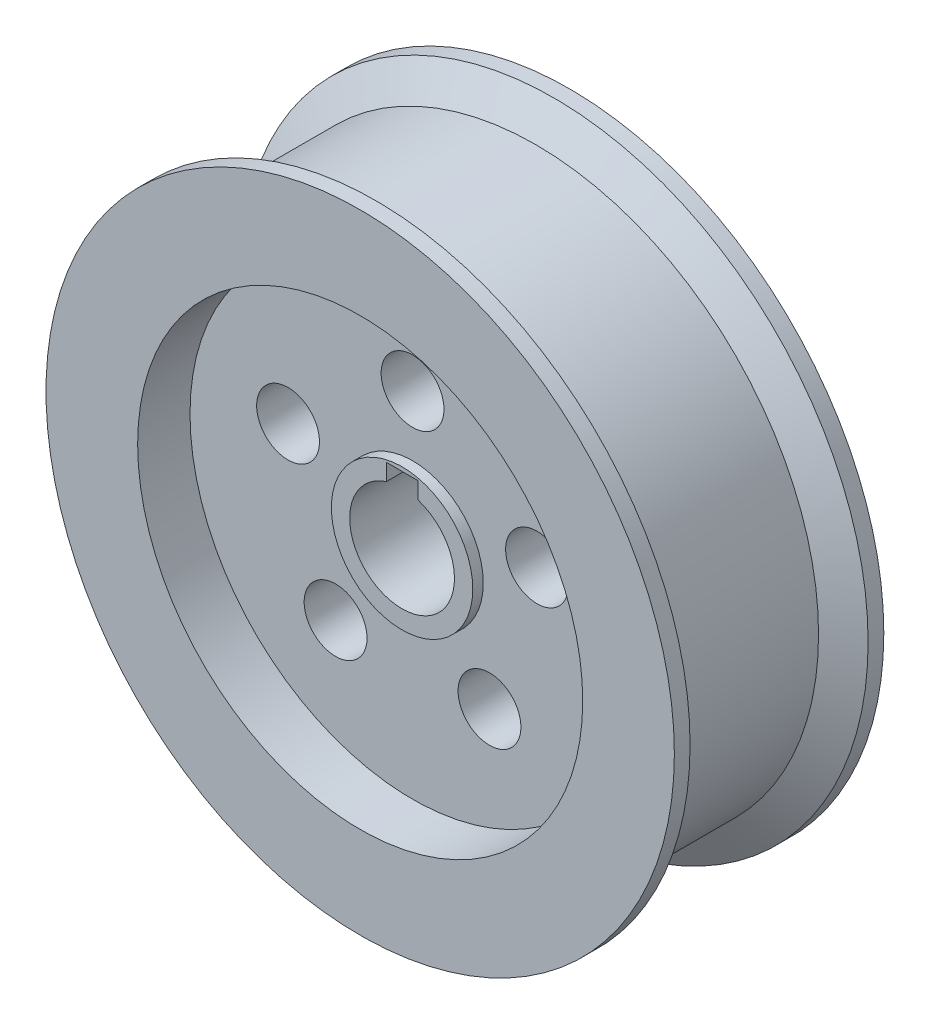
ISO-10303-21;
HEADER;
FILE_DESCRIPTION(('STEP AP214'),'2;1');
FILE_NAME('part.step','',(''),(''),'','','');
FILE_SCHEMA(('AUTOMOTIVE_DESIGN { 1 0 10303 214 1 1 1 1 }'));
ENDSEC;
DATA;
#1=APPLICATION_CONTEXT('core data for automotive mechanical design processes');
#2=APPLICATION_PROTOCOL_DEFINITION('international standard','automotive_design',2000,#1);
#3=PRODUCT_CONTEXT('',#1,'mechanical');
#4=PRODUCT('Part','Part','',(#3));
#5=PRODUCT_RELATED_PRODUCT_CATEGORY('part','',(#4));
#6=PRODUCT_DEFINITION_FORMATION('','',#4);
#7=PRODUCT_DEFINITION_CONTEXT('part definition',#1,'design');
#8=PRODUCT_DEFINITION('design','',#6,#7);
#9=PRODUCT_DEFINITION_SHAPE('','',#8);
#10=(LENGTH_UNIT() NAMED_UNIT(*) SI_UNIT(.MILLI.,.METRE.));
#11=(NAMED_UNIT(*) PLANE_ANGLE_UNIT() SI_UNIT($,.RADIAN.));
#12=(NAMED_UNIT(*) SI_UNIT($,.STERADIAN.) SOLID_ANGLE_UNIT());
#13=UNCERTAINTY_MEASURE_WITH_UNIT(LENGTH_MEASURE(1.E-05),#10,'distance_accuracy_value','');
#14=(GEOMETRIC_REPRESENTATION_CONTEXT(3) GLOBAL_UNCERTAINTY_ASSIGNED_CONTEXT((#13)) GLOBAL_UNIT_ASSIGNED_CONTEXT((#10,
#11,#12)) REPRESENTATION_CONTEXT('',''));
#15=CARTESIAN_POINT('',(0.,0.,0.));
#16=DIRECTION('',(0.,0.,1.));
#17=DIRECTION('',(1.,0.,0.));
#18=AXIS2_PLACEMENT_3D('',#15,#16,#17);
#19=CARTESIAN_POINT('',(0.,0.,20.));
#20=DIRECTION('',(0.,0.,-1.));
#21=DIRECTION('',(-1.,0.,0.));
#22=AXIS2_PLACEMENT_3D('',#19,#20,#21);
#23=CYLINDRICAL_SURFACE('',#22,60.);
#24=CARTESIAN_POINT('',(0.,0.,-17.));
#25=DIRECTION('',(0.,0.,1.));
#26=DIRECTION('',(1.,0.,0.));
#27=AXIS2_PLACEMENT_3D('',#24,#25,#26);
#28=CIRCLE('',#27,60.);
#29=CARTESIAN_POINT('',(60.,0.,-17.));
#30=VERTEX_POINT('',#29);
#31=EDGE_CURVE('E129',#30,#30,#28,.T.);
#32=ORIENTED_EDGE('',*,*,#31,.F.);
#33=EDGE_LOOP('',(#32));
#34=FACE_BOUND('',#33,.T.);
#35=CARTESIAN_POINT('',(0.,0.,-20.));
#36=DIRECTION('',(0.,0.,1.));
#37=DIRECTION('',(1.,0.,0.));
#38=AXIS2_PLACEMENT_3D('',#35,#36,#37);
#39=CIRCLE('',#38,60.);
#40=CARTESIAN_POINT('',(60.,0.,-20.));
#41=VERTEX_POINT('',#40);
#42=EDGE_CURVE('E174',#41,#41,#39,.T.);
#43=ORIENTED_EDGE('',*,*,#42,.T.);
#44=EDGE_LOOP('',(#43));
#45=FACE_BOUND('',#44,.T.);
#46=ADVANCED_FACE('F41',(#34,#45),#23,.T.);
#47=CARTESIAN_POINT('',(0.,0.,20.));
#48=DIRECTION('',(0.,0.,-1.));
#49=DIRECTION('',(-1.,0.,0.));
#50=AXIS2_PLACEMENT_3D('',#47,#48,#49);
#51=CYLINDRICAL_SURFACE('',#50,10.);
#52=DIRECTION('',(0.,0.,-1.));
#53=VECTOR('',#52,1.);
#54=CARTESIAN_POINT('',(-3.,9.53939201416946,20.));
#55=LINE('',#54,#53);
#56=CARTESIAN_POINT('',(-3.,9.53939201416946,12.));
#57=VERTEX_POINT('',#56);
#58=CARTESIAN_POINT('',(-3.,9.53939201416946,-10.));
#59=VERTEX_POINT('',#58);
#60=EDGE_CURVE('E64',#57,#59,#55,.T.);
#61=ORIENTED_EDGE('',*,*,#60,.F.);
#62=CARTESIAN_POINT('',(0.,0.,12.));
#63=DIRECTION('',(0.,0.,1.));
#64=DIRECTION('',(1.,0.,0.));
#65=AXIS2_PLACEMENT_3D('',#62,#63,#64);
#66=CIRCLE('',#65,10.);
#67=CARTESIAN_POINT('',(3.,9.53939201416946,12.));
#68=VERTEX_POINT('',#67);
#69=EDGE_CURVE('E113',#57,#68,#66,.T.);
#70=ORIENTED_EDGE('',*,*,#69,.T.);
#71=DIRECTION('',(0.,0.,-1.));
#72=VECTOR('',#71,1.);
#73=CARTESIAN_POINT('',(3.,9.53939201416946,20.));
#74=LINE('',#73,#72);
#75=CARTESIAN_POINT('',(3.,9.53939201416946,-10.));
#76=VERTEX_POINT('',#75);
#77=EDGE_CURVE('E88',#76,#68,#74,.F.);
#78=ORIENTED_EDGE('',*,*,#77,.F.);
#79=CARTESIAN_POINT('',(0.,0.,-10.));
#80=DIRECTION('',(0.,0.,-1.));
#81=DIRECTION('',(-1.,0.,0.));
#82=AXIS2_PLACEMENT_3D('',#79,#80,#81);
#83=CIRCLE('',#82,10.);
#84=EDGE_CURVE('E102',#76,#59,#83,.T.);
#85=ORIENTED_EDGE('',*,*,#84,.T.);
#86=EDGE_LOOP('',(#61,#70,#78,#85));
#87=FACE_BOUND('',#86,.T.);
#88=ADVANCED_FACE('F219',(#87),#51,.F.);
#89=CARTESIAN_POINT('',(0.,0.,20.));
#90=DIRECTION('',(0.,0.,1.));
#91=DIRECTION('',(1.,0.,0.));
#92=AXIS2_PLACEMENT_3D('',#89,#90,#91);
#93=PLANE('',#92);
#94=CARTESIAN_POINT('',(0.,0.,20.));
#95=DIRECTION('',(0.,0.,1.));
#96=DIRECTION('',(1.,0.,0.));
#97=AXIS2_PLACEMENT_3D('',#94,#95,#96);
#98=CIRCLE('',#97,42.5);
#99=CARTESIAN_POINT('',(42.5,0.,20.));
#100=VERTEX_POINT('',#99);
#101=EDGE_CURVE('E175',#100,#100,#98,.T.);
#102=ORIENTED_EDGE('',*,*,#101,.F.);
#103=EDGE_LOOP('',(#102));
#104=FACE_BOUND('',#103,.T.);
#105=CARTESIAN_POINT('',(0.,0.,20.));
#106=DIRECTION('',(0.,0.,1.));
#107=DIRECTION('',(1.,0.,0.));
#108=AXIS2_PLACEMENT_3D('',#105,#106,#107);
#109=CIRCLE('',#108,60.);
#110=CARTESIAN_POINT('',(60.,0.,20.));
#111=VERTEX_POINT('',#110);
#112=EDGE_CURVE('E179',#111,#111,#109,.T.);
#113=ORIENTED_EDGE('',*,*,#112,.T.);
#114=EDGE_LOOP('',(#113));
#115=FACE_BOUND('',#114,.T.);
#116=ADVANCED_FACE('F221',(#104,#115),#93,.T.);
#117=CARTESIAN_POINT('',(0.,0.,-20.));
#118=DIRECTION('',(0.,0.,1.));
#119=DIRECTION('',(1.,0.,0.));
#120=AXIS2_PLACEMENT_3D('',#117,#118,#119);
#121=PLANE('',#120);
#122=CARTESIAN_POINT('',(0.,0.,-20.));
#123=DIRECTION('',(0.,0.,1.));
#124=DIRECTION('',(1.,0.,0.));
#125=AXIS2_PLACEMENT_3D('',#122,#123,#124);
#126=CIRCLE('',#125,42.5);
#127=CARTESIAN_POINT('',(42.5,0.,-20.));
#128=VERTEX_POINT('',#127);
#129=EDGE_CURVE('E162',#128,#128,#126,.T.);
#130=ORIENTED_EDGE('',*,*,#129,.T.);
#131=EDGE_LOOP('',(#130));
#132=FACE_BOUND('',#131,.T.);
#133=ORIENTED_EDGE('',*,*,#42,.F.);
#134=EDGE_LOOP('',(#133));
#135=FACE_BOUND('',#134,.T.);
#136=ADVANCED_FACE('F227',(#132,#135),#121,.F.);
#137=CARTESIAN_POINT('',(0.,0.,17.));
#138=DIRECTION('',(0.,0.,1.));
#139=DIRECTION('',(1.,0.,0.));
#140=AXIS2_PLACEMENT_3D('',#137,#138,#139);
#141=CIRCLE('',#140,60.);
#142=CARTESIAN_POINT('',(60.,0.,17.));
#143=VERTEX_POINT('',#142);
#144=EDGE_CURVE('E125',#143,#143,#141,.T.);
#145=ORIENTED_EDGE('',*,*,#144,.T.);
#146=EDGE_LOOP('',(#145));
#147=FACE_BOUND('',#146,.T.);
#148=ORIENTED_EDGE('',*,*,#112,.F.);
#149=EDGE_LOOP('',(#148));
#150=FACE_BOUND('',#149,.T.);
#151=ADVANCED_FACE('F43',(#147,#150),#23,.T.);
#152=CARTESIAN_POINT('',(0.,0.,10.));
#153=DIRECTION('',(0.,0.,1.));
#154=DIRECTION('',(1.,0.,0.));
#155=AXIS2_PLACEMENT_3D('',#152,#153,#154);
#156=CYLINDRICAL_SURFACE('',#155,42.5);
#157=CARTESIAN_POINT('',(0.,0.,10.));
#158=DIRECTION('',(0.,0.,1.));
#159=DIRECTION('',(1.,0.,0.));
#160=AXIS2_PLACEMENT_3D('',#157,#158,#159);
#161=CIRCLE('',#160,42.5);
#162=CARTESIAN_POINT('',(42.5,0.,10.));
#163=VERTEX_POINT('',#162);
#164=EDGE_CURVE('E170',#163,#163,#161,.T.);
#165=ORIENTED_EDGE('',*,*,#164,.F.);
#166=EDGE_LOOP('',(#165));
#167=FACE_BOUND('',#166,.T.);
#168=ORIENTED_EDGE('',*,*,#101,.T.);
#169=EDGE_LOOP('',(#168));
#170=FACE_BOUND('',#169,.T.);
#171=ADVANCED_FACE('F232',(#167,#170),#156,.F.);
#172=CARTESIAN_POINT('',(0.,0.,10.));
#173=DIRECTION('',(0.,0.,1.));
#174=DIRECTION('',(1.,0.,0.));
#175=AXIS2_PLACEMENT_3D('',#172,#173,#174);
#176=PLANE('',#175);
#177=CARTESIAN_POINT('',(0.,0.,10.));
#178=DIRECTION('',(0.,0.,1.));
#179=DIRECTION('',(1.,0.,0.));
#180=AXIS2_PLACEMENT_3D('',#177,#178,#179);
#181=CIRCLE('',#180,13.5);
#182=CARTESIAN_POINT('',(13.5,0.,10.));
#183=VERTEX_POINT('',#182);
#184=EDGE_CURVE('E183',#183,#183,#181,.T.);
#185=ORIENTED_EDGE('',*,*,#184,.F.);
#186=EDGE_LOOP('',(#185));
#187=FACE_BOUND('',#186,.T.);
#188=CARTESIAN_POINT('',(14.6946313073117,-20.2254248593738,10.));
#189=DIRECTION('',(0.,0.,1.));
#190=DIRECTION('',(1.,0.,0.));
#191=AXIS2_PLACEMENT_3D('',#188,#189,#190);
#192=CIRCLE('',#191,6.);
#193=CARTESIAN_POINT('',(20.6946313073117,-20.2254248593738,10.));
#194=VERTEX_POINT('',#193);
#195=EDGE_CURVE('E148',#194,#194,#192,.T.);
#196=ORIENTED_EDGE('',*,*,#195,.F.);
#197=EDGE_LOOP('',(#196));
#198=FACE_BOUND('',#197,.T.);
#199=CARTESIAN_POINT('',(-14.694631307312,-20.2254248593736,10.));
#200=DIRECTION('',(0.,0.,1.));
#201=DIRECTION('',(1.,0.,0.));
#202=AXIS2_PLACEMENT_3D('',#199,#200,#201);
#203=CIRCLE('',#202,6.);
#204=CARTESIAN_POINT('',(-8.69463130731201,-20.2254248593736,10.));
#205=VERTEX_POINT('',#204);
#206=EDGE_CURVE('E143',#205,#205,#203,.T.);
#207=ORIENTED_EDGE('',*,*,#206,.F.);
#208=EDGE_LOOP('',(#207));
#209=FACE_BOUND('',#208,.T.);
#210=CARTESIAN_POINT('',(-23.7764129073788,7.72542485937396,10.));
#211=DIRECTION('',(0.,0.,1.));
#212=DIRECTION('',(1.,0.,0.));
#213=AXIS2_PLACEMENT_3D('',#210,#211,#212);
#214=CIRCLE('',#213,6.);
#215=CARTESIAN_POINT('',(-17.7764129073787,7.72542485937396,10.));
#216=VERTEX_POINT('',#215);
#217=EDGE_CURVE('E138',#216,#216,#214,.T.);
#218=ORIENTED_EDGE('',*,*,#217,.F.);
#219=EDGE_LOOP('',(#218));
#220=FACE_BOUND('',#219,.T.);
#221=CARTESIAN_POINT('',(23.7764129073789,7.72542485937362,10.));
#222=DIRECTION('',(0.,0.,1.));
#223=DIRECTION('',(1.,0.,0.));
#224=AXIS2_PLACEMENT_3D('',#221,#222,#223);
#225=CIRCLE('',#224,6.);
#226=CARTESIAN_POINT('',(29.7764129073789,7.72542485937362,10.));
#227=VERTEX_POINT('',#226);
#228=EDGE_CURVE('E153',#227,#227,#225,.T.);
#229=ORIENTED_EDGE('',*,*,#228,.F.);
#230=EDGE_LOOP('',(#229));
#231=FACE_BOUND('',#230,.T.);
#232=CARTESIAN_POINT('',(0.,25.,10.));
#233=DIRECTION('',(0.,0.,1.));
#234=DIRECTION('',(1.,0.,0.));
#235=AXIS2_PLACEMENT_3D('',#232,#233,#234);
#236=CIRCLE('',#235,6.);
#237=CARTESIAN_POINT('',(6.,25.,10.));
#238=VERTEX_POINT('',#237);
#239=EDGE_CURVE('E158',#238,#238,#236,.T.);
#240=ORIENTED_EDGE('',*,*,#239,.F.);
#241=EDGE_LOOP('',(#240));
#242=FACE_BOUND('',#241,.T.);
#243=ORIENTED_EDGE('',*,*,#164,.T.);
#244=EDGE_LOOP('',(#243));
#245=FACE_BOUND('',#244,.T.);
#246=ADVANCED_FACE('F247',(#187,#198,#209,#220,#231,#242,#245),#176,.T.);
#247=CARTESIAN_POINT('',(0.,0.,-10.));
#248=DIRECTION('',(0.,0.,-1.));
#249=DIRECTION('',(-1.,0.,0.));
#250=AXIS2_PLACEMENT_3D('',#247,#248,#249);
#251=CYLINDRICAL_SURFACE('',#250,42.5);
#252=CARTESIAN_POINT('',(0.,0.,-10.));
#253=DIRECTION('',(0.,0.,1.));
#254=DIRECTION('',(1.,0.,0.));
#255=AXIS2_PLACEMENT_3D('',#252,#253,#254);
#256=CIRCLE('',#255,42.5);
#257=CARTESIAN_POINT('',(42.5,0.,-10.));
#258=VERTEX_POINT('',#257);
#259=EDGE_CURVE('E163',#258,#258,#256,.T.);
#260=ORIENTED_EDGE('',*,*,#259,.T.);
#261=EDGE_LOOP('',(#260));
#262=FACE_BOUND('',#261,.T.);
#263=ORIENTED_EDGE('',*,*,#129,.F.);
#264=EDGE_LOOP('',(#263));
#265=FACE_BOUND('',#264,.T.);
#266=ADVANCED_FACE('F245',(#262,#265),#251,.F.);
#267=CARTESIAN_POINT('',(0.,0.,-10.));
#268=DIRECTION('',(0.,0.,-1.));
#269=DIRECTION('',(1.,0.,0.));
#270=AXIS2_PLACEMENT_3D('',#267,#268,#269);
#271=PLANE('',#270);
#272=DIRECTION('',(0.,1.,0.));
#273=VECTOR('',#272,1.);
#274=CARTESIAN_POINT('',(-3.,0.,-10.));
#275=LINE('',#274,#273);
#276=CARTESIAN_POINT('',(-3.,12.7268825510784,-10.));
#277=VERTEX_POINT('',#276);
#278=EDGE_CURVE('E107',#59,#277,#275,.T.);
#279=ORIENTED_EDGE('',*,*,#278,.F.);
#280=ORIENTED_EDGE('',*,*,#84,.F.);
#281=DIRECTION('',(0.,-1.,0.));
#282=VECTOR('',#281,1.);
#283=CARTESIAN_POINT('',(3.,0.,-10.));
#284=LINE('',#283,#282);
#285=CARTESIAN_POINT('',(3.,12.7268825510784,-10.));
#286=VERTEX_POINT('',#285);
#287=EDGE_CURVE('E92',#286,#76,#284,.T.);
#288=ORIENTED_EDGE('',*,*,#287,.F.);
#289=DIRECTION('',(1.,0.,0.));
#290=VECTOR('',#289,1.);
#291=CARTESIAN_POINT('',(0.,12.7268825510784,-10.));
#292=LINE('',#291,#290);
#293=EDGE_CURVE('E81',#277,#286,#292,.T.);
#294=ORIENTED_EDGE('',*,*,#293,.F.);
#295=EDGE_LOOP('',(#279,#280,#288,#294));
#296=FACE_BOUND('',#295,.T.);
#297=CARTESIAN_POINT('',(14.6946313073117,-20.2254248593738,-10.));
#298=DIRECTION('',(0.,0.,-1.));
#299=DIRECTION('',(-1.,0.,0.));
#300=AXIS2_PLACEMENT_3D('',#297,#298,#299);
#301=CIRCLE('',#300,6.);
#302=CARTESIAN_POINT('',(8.69463130731171,-20.2254248593738,-10.));
#303=VERTEX_POINT('',#302);
#304=EDGE_CURVE('E147',#303,#303,#301,.T.);
#305=ORIENTED_EDGE('',*,*,#304,.F.);
#306=EDGE_LOOP('',(#305));
#307=FACE_BOUND('',#306,.T.);
#308=CARTESIAN_POINT('',(-14.694631307312,-20.2254248593736,-10.));
#309=DIRECTION('',(0.,0.,-1.));
#310=DIRECTION('',(-1.,0.,0.));
#311=AXIS2_PLACEMENT_3D('',#308,#309,#310);
#312=CIRCLE('',#311,6.);
#313=CARTESIAN_POINT('',(-20.694631307312,-20.2254248593736,-10.));
#314=VERTEX_POINT('',#313);
#315=EDGE_CURVE('E142',#314,#314,#312,.T.);
#316=ORIENTED_EDGE('',*,*,#315,.F.);
#317=EDGE_LOOP('',(#316));
#318=FACE_BOUND('',#317,.T.);
#319=CARTESIAN_POINT('',(-23.7764129073788,7.72542485937396,-10.));
#320=DIRECTION('',(0.,0.,-1.));
#321=DIRECTION('',(-1.,0.,0.));
#322=AXIS2_PLACEMENT_3D('',#319,#320,#321);
#323=CIRCLE('',#322,6.);
#324=CARTESIAN_POINT('',(-29.7764129073788,7.72542485937396,-10.));
#325=VERTEX_POINT('',#324);
#326=EDGE_CURVE('E137',#325,#325,#323,.T.);
#327=ORIENTED_EDGE('',*,*,#326,.F.);
#328=EDGE_LOOP('',(#327));
#329=FACE_BOUND('',#328,.T.);
#330=CARTESIAN_POINT('',(23.7764129073789,7.72542485937362,-10.));
#331=DIRECTION('',(0.,0.,-1.));
#332=DIRECTION('',(-1.,0.,0.));
#333=AXIS2_PLACEMENT_3D('',#330,#331,#332);
#334=CIRCLE('',#333,6.);
#335=CARTESIAN_POINT('',(17.7764129073789,7.72542485937362,-10.));
#336=VERTEX_POINT('',#335);
#337=EDGE_CURVE('E152',#336,#336,#334,.T.);
#338=ORIENTED_EDGE('',*,*,#337,.F.);
#339=EDGE_LOOP('',(#338));
#340=FACE_BOUND('',#339,.T.);
#341=CARTESIAN_POINT('',(0.,25.,-10.));
#342=DIRECTION('',(0.,0.,-1.));
#343=DIRECTION('',(-1.,0.,0.));
#344=AXIS2_PLACEMENT_3D('',#341,#342,#343);
#345=CIRCLE('',#344,6.);
#346=CARTESIAN_POINT('',(-6.,25.,-10.));
#347=VERTEX_POINT('',#346);
#348=EDGE_CURVE('E157',#347,#347,#345,.T.);
#349=ORIENTED_EDGE('',*,*,#348,.F.);
#350=EDGE_LOOP('',(#349));
#351=FACE_BOUND('',#350,.T.);
#352=ORIENTED_EDGE('',*,*,#259,.F.);
#353=EDGE_LOOP('',(#352));
#354=FACE_BOUND('',#353,.T.);
#355=ADVANCED_FACE('F99',(#296,#307,#318,#329,#340,#351,#354),#271,.T.);
#356=CARTESIAN_POINT('',(0.,25.,-20.));
#357=DIRECTION('',(0.,0.,1.));
#358=DIRECTION('',(1.,0.,0.));
#359=AXIS2_PLACEMENT_3D('',#356,#357,#358);
#360=CYLINDRICAL_SURFACE('',#359,6.);
#361=ORIENTED_EDGE('',*,*,#239,.T.);
#362=EDGE_LOOP('',(#361));
#363=FACE_BOUND('',#362,.T.);
#364=ORIENTED_EDGE('',*,*,#348,.T.);
#365=EDGE_LOOP('',(#364));
#366=FACE_BOUND('',#365,.T.);
#367=ADVANCED_FACE('F254',(#363,#366),#360,.F.);
#368=CARTESIAN_POINT('',(23.7764129073789,7.72542485937362,-20.));
#369=DIRECTION('',(0.,0.,1.));
#370=DIRECTION('',(1.,0.,0.));
#371=AXIS2_PLACEMENT_3D('',#368,#369,#370);
#372=CYLINDRICAL_SURFACE('',#371,6.);
#373=ORIENTED_EDGE('',*,*,#228,.T.);
#374=EDGE_LOOP('',(#373));
#375=FACE_BOUND('',#374,.T.);
#376=ORIENTED_EDGE('',*,*,#337,.T.);
#377=EDGE_LOOP('',(#376));
#378=FACE_BOUND('',#377,.T.);
#379=ADVANCED_FACE('F260',(#375,#378),#372,.F.);
#380=CARTESIAN_POINT('',(-23.7764129073788,7.72542485937396,-20.));
#381=DIRECTION('',(0.,0.,1.));
#382=DIRECTION('',(1.,0.,0.));
#383=AXIS2_PLACEMENT_3D('',#380,#381,#382);
#384=CYLINDRICAL_SURFACE('',#383,6.);
#385=ORIENTED_EDGE('',*,*,#217,.T.);
#386=EDGE_LOOP('',(#385));
#387=FACE_BOUND('',#386,.T.);
#388=ORIENTED_EDGE('',*,*,#326,.T.);
#389=EDGE_LOOP('',(#388));
#390=FACE_BOUND('',#389,.T.);
#391=ADVANCED_FACE('F264',(#387,#390),#384,.F.);
#392=CARTESIAN_POINT('',(-14.694631307312,-20.2254248593736,-20.));
#393=DIRECTION('',(0.,0.,1.));
#394=DIRECTION('',(1.,0.,0.));
#395=AXIS2_PLACEMENT_3D('',#392,#393,#394);
#396=CYLINDRICAL_SURFACE('',#395,6.);
#397=ORIENTED_EDGE('',*,*,#206,.T.);
#398=EDGE_LOOP('',(#397));
#399=FACE_BOUND('',#398,.T.);
#400=ORIENTED_EDGE('',*,*,#315,.T.);
#401=EDGE_LOOP('',(#400));
#402=FACE_BOUND('',#401,.T.);
#403=ADVANCED_FACE('F268',(#399,#402),#396,.F.);
#404=CARTESIAN_POINT('',(14.6946313073117,-20.2254248593738,-20.));
#405=DIRECTION('',(0.,0.,1.));
#406=DIRECTION('',(1.,0.,0.));
#407=AXIS2_PLACEMENT_3D('',#404,#405,#406);
#408=CYLINDRICAL_SURFACE('',#407,6.);
#409=ORIENTED_EDGE('',*,*,#195,.T.);
#410=EDGE_LOOP('',(#409));
#411=FACE_BOUND('',#410,.T.);
#412=ORIENTED_EDGE('',*,*,#304,.T.);
#413=EDGE_LOOP('',(#412));
#414=FACE_BOUND('',#413,.T.);
#415=ADVANCED_FACE('F272',(#411,#414),#408,.F.);
#416=CARTESIAN_POINT('',(0.,0.,0.));
#417=DIRECTION('',(0.,0.,1.));
#418=DIRECTION('',(1.,0.,0.));
#419=AXIS2_PLACEMENT_3D('',#416,#417,#418);
#420=CYLINDRICAL_SURFACE('',#419,54.);
#421=CARTESIAN_POINT('',(0.,0.,13.5358983848622));
#422=DIRECTION('',(0.,0.,1.));
#423=DIRECTION('',(1.,0.,0.));
#424=AXIS2_PLACEMENT_3D('',#421,#422,#423);
#425=CIRCLE('',#424,54.);
#426=CARTESIAN_POINT('',(54.,0.,13.5358983848622));
#427=VERTEX_POINT('',#426);
#428=EDGE_CURVE('E121',#427,#427,#425,.T.);
#429=ORIENTED_EDGE('',*,*,#428,.F.);
#430=EDGE_LOOP('',(#429));
#431=FACE_BOUND('',#430,.T.);
#432=CARTESIAN_POINT('',(0.,0.,-13.5358983848622));
#433=DIRECTION('',(0.,0.,1.));
#434=DIRECTION('',(1.,0.,0.));
#435=AXIS2_PLACEMENT_3D('',#432,#433,#434);
#436=CIRCLE('',#435,54.);
#437=CARTESIAN_POINT('',(54.,0.,-13.5358983848622));
#438=VERTEX_POINT('',#437);
#439=EDGE_CURVE('E133',#438,#438,#436,.T.);
#440=ORIENTED_EDGE('',*,*,#439,.T.);
#441=EDGE_LOOP('',(#440));
#442=FACE_BOUND('',#441,.T.);
#443=ADVANCED_FACE('F276',(#431,#442),#420,.T.);
#444=CARTESIAN_POINT('',(0.,0.,-17.));
#445=DIRECTION('',(0.,0.,-1.));
#446=DIRECTION('',(-1.,0.,0.));
#447=AXIS2_PLACEMENT_3D('',#444,#445,#446);
#448=CONICAL_SURFACE('',#447,60.,1.04719755119659);
#449=ORIENTED_EDGE('',*,*,#439,.F.);
#450=EDGE_LOOP('',(#449));
#451=FACE_BOUND('',#450,.T.);
#452=ORIENTED_EDGE('',*,*,#31,.T.);
#453=EDGE_LOOP('',(#452));
#454=FACE_BOUND('',#453,.T.);
#455=ADVANCED_FACE('F280',(#451,#454),#448,.T.);
#456=CARTESIAN_POINT('',(0.,0.,13.5358983848622));
#457=DIRECTION('',(0.,0.,1.));
#458=DIRECTION('',(1.,0.,0.));
#459=AXIS2_PLACEMENT_3D('',#456,#457,#458);
#460=CONICAL_SURFACE('',#459,54.,1.04719755119659);
#461=ORIENTED_EDGE('',*,*,#144,.F.);
#462=EDGE_LOOP('',(#461));
#463=FACE_BOUND('',#462,.T.);
#464=ORIENTED_EDGE('',*,*,#428,.T.);
#465=EDGE_LOOP('',(#464));
#466=FACE_BOUND('',#465,.T.);
#467=ADVANCED_FACE('F284',(#463,#466),#460,.T.);
#468=CARTESIAN_POINT('',(0.,0.,3.));
#469=DIRECTION('',(0.,0.,1.));
#470=DIRECTION('',(1.,0.,0.));
#471=AXIS2_PLACEMENT_3D('',#468,#469,#470);
#472=CYLINDRICAL_SURFACE('',#471,13.5);
#473=ORIENTED_EDGE('',*,*,#184,.T.);
#474=EDGE_LOOP('',(#473));
#475=FACE_BOUND('',#474,.T.);
#476=CARTESIAN_POINT('',(0.,0.,12.));
#477=DIRECTION('',(0.,0.,1.));
#478=DIRECTION('',(1.,0.,0.));
#479=AXIS2_PLACEMENT_3D('',#476,#477,#478);
#480=CIRCLE('',#479,13.5);
#481=CARTESIAN_POINT('',(13.5,0.,12.));
#482=VERTEX_POINT('',#481);
#483=EDGE_CURVE('E117',#482,#482,#480,.T.);
#484=ORIENTED_EDGE('',*,*,#483,.F.);
#485=EDGE_LOOP('',(#484));
#486=FACE_BOUND('',#485,.T.);
#487=ADVANCED_FACE('F288',(#475,#486),#472,.T.);
#488=CARTESIAN_POINT('',(0.,0.,12.));
#489=DIRECTION('',(0.,0.,1.));
#490=DIRECTION('',(1.,0.,0.));
#491=AXIS2_PLACEMENT_3D('',#488,#489,#490);
#492=PLANE('',#491);
#493=DIRECTION('',(0.,-1.,0.));
#494=VECTOR('',#493,1.);
#495=CARTESIAN_POINT('',(-3.,0.,12.));
#496=LINE('',#495,#494);
#497=CARTESIAN_POINT('',(-3.,12.7268825510784,12.));
#498=VERTEX_POINT('',#497);
#499=EDGE_CURVE('E11',#498,#57,#496,.T.);
#500=ORIENTED_EDGE('',*,*,#499,.F.);
#501=DIRECTION('',(-1.,0.,0.));
#502=VECTOR('',#501,1.);
#503=CARTESIAN_POINT('',(0.,12.7268825510784,12.));
#504=LINE('',#503,#502);
#505=CARTESIAN_POINT('',(3.,12.7268825510784,12.));
#506=VERTEX_POINT('',#505);
#507=EDGE_CURVE('E207',#506,#498,#504,.T.);
#508=ORIENTED_EDGE('',*,*,#507,.F.);
#509=DIRECTION('',(0.,1.,0.));
#510=VECTOR('',#509,1.);
#511=CARTESIAN_POINT('',(3.,0.,12.));
#512=LINE('',#511,#510);
#513=EDGE_CURVE('E50',#68,#506,#512,.T.);
#514=ORIENTED_EDGE('',*,*,#513,.F.);
#515=ORIENTED_EDGE('',*,*,#69,.F.);
#516=EDGE_LOOP('',(#500,#508,#514,#515));
#517=FACE_BOUND('',#516,.T.);
#518=ORIENTED_EDGE('',*,*,#483,.T.);
#519=EDGE_LOOP('',(#518));
#520=FACE_BOUND('',#519,.T.);
#521=ADVANCED_FACE('F216',(#517,#520),#492,.T.);
#522=CARTESIAN_POINT('',(-3.,9.51688255107839,20.));
#523=DIRECTION('',(-1.,0.,0.));
#524=DIRECTION('',(0.,0.,1.));
#525=AXIS2_PLACEMENT_3D('',#522,#523,#524);
#526=PLANE('',#525);
#527=ORIENTED_EDGE('',*,*,#278,.T.);
#528=DIRECTION('',(0.,0.,-1.));
#529=VECTOR('',#528,1.);
#530=CARTESIAN_POINT('',(-3.,12.7268825510784,20.));
#531=LINE('',#530,#529);
#532=EDGE_CURVE('E84',#498,#277,#531,.T.);
#533=ORIENTED_EDGE('',*,*,#532,.F.);
#534=ORIENTED_EDGE('',*,*,#499,.T.);
#535=ORIENTED_EDGE('',*,*,#60,.T.);
#536=EDGE_LOOP('',(#527,#533,#534,#535));
#537=FACE_BOUND('',#536,.T.);
#538=ADVANCED_FACE('F212',(#537),#526,.F.);
#539=CARTESIAN_POINT('',(3.,9.51688255107839,20.));
#540=DIRECTION('',(1.,0.,0.));
#541=DIRECTION('',(0.,1.,0.));
#542=AXIS2_PLACEMENT_3D('',#539,#540,#541);
#543=PLANE('',#542);
#544=ORIENTED_EDGE('',*,*,#287,.T.);
#545=ORIENTED_EDGE('',*,*,#77,.T.);
#546=ORIENTED_EDGE('',*,*,#513,.T.);
#547=DIRECTION('',(0.,0.,-1.));
#548=VECTOR('',#547,1.);
#549=CARTESIAN_POINT('',(3.,12.7268825510784,20.));
#550=LINE('',#549,#548);
#551=EDGE_CURVE('E57',#506,#286,#550,.T.);
#552=ORIENTED_EDGE('',*,*,#551,.T.);
#553=EDGE_LOOP('',(#544,#545,#546,#552));
#554=FACE_BOUND('',#553,.T.);
#555=ADVANCED_FACE('F91',(#554),#543,.F.);
#556=CARTESIAN_POINT('',(3.,12.7268825510784,20.));
#557=DIRECTION('',(0.,1.,0.));
#558=DIRECTION('',(0.,0.,1.));
#559=AXIS2_PLACEMENT_3D('',#556,#557,#558);
#560=PLANE('',#559);
#561=ORIENTED_EDGE('',*,*,#293,.T.);
#562=ORIENTED_EDGE('',*,*,#551,.F.);
#563=ORIENTED_EDGE('',*,*,#507,.T.);
#564=ORIENTED_EDGE('',*,*,#532,.T.);
#565=EDGE_LOOP('',(#561,#562,#563,#564));
#566=FACE_BOUND('',#565,.T.);
#567=ADVANCED_FACE('F82',(#566),#560,.F.);
#568=CLOSED_SHELL('',(#46,#88,#116,#136,#151,#171,#246,#266,#355,#367,#379,#391,#403,#415,#443,
#455,#467,#487,#521,#538,#555,#567));
#569=MANIFOLD_SOLID_BREP('B2',#568);
#570=ADVANCED_BREP_SHAPE_REPRESENTATION('',(#18,#569),#14);
#571=SHAPE_DEFINITION_REPRESENTATION(#9,#570);
ENDSEC;
END-ISO-10303-21;
